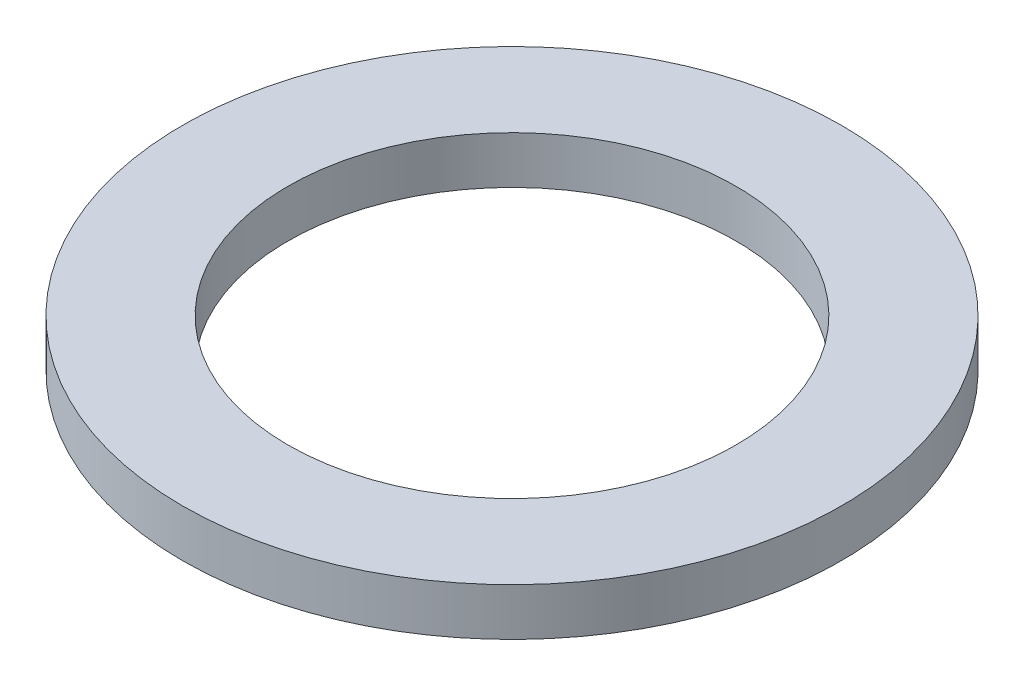
ISO-10303-21;
HEADER;
FILE_DESCRIPTION(('STEP AP214'),'2;1');
FILE_NAME('part.step','',(''),(''),'','','');
FILE_SCHEMA(('AUTOMOTIVE_DESIGN { 1 0 10303 214 1 1 1 1 }'));
ENDSEC;
DATA;
#1=APPLICATION_CONTEXT('core data for automotive mechanical design processes');
#2=APPLICATION_PROTOCOL_DEFINITION('international standard','automotive_design',2000,#1);
#3=PRODUCT_CONTEXT('',#1,'mechanical');
#4=PRODUCT('Part','Part','',(#3));
#5=PRODUCT_RELATED_PRODUCT_CATEGORY('part','',(#4));
#6=PRODUCT_DEFINITION_FORMATION('','',#4);
#7=PRODUCT_DEFINITION_CONTEXT('part definition',#1,'design');
#8=PRODUCT_DEFINITION('design','',#6,#7);
#9=PRODUCT_DEFINITION_SHAPE('','',#8);
#10=(LENGTH_UNIT() NAMED_UNIT(*) SI_UNIT(.MILLI.,.METRE.));
#11=(NAMED_UNIT(*) PLANE_ANGLE_UNIT() SI_UNIT($,.RADIAN.));
#12=(NAMED_UNIT(*) SI_UNIT($,.STERADIAN.) SOLID_ANGLE_UNIT());
#13=UNCERTAINTY_MEASURE_WITH_UNIT(LENGTH_MEASURE(1.E-05),#10,'distance_accuracy_value','');
#14=(GEOMETRIC_REPRESENTATION_CONTEXT(3) GLOBAL_UNCERTAINTY_ASSIGNED_CONTEXT((#13)) GLOBAL_UNIT_ASSIGNED_CONTEXT((#10,
#11,#12)) REPRESENTATION_CONTEXT('',''));
#15=CARTESIAN_POINT('',(0.,0.,0.));
#16=DIRECTION('',(0.,0.,1.));
#17=DIRECTION('',(1.,0.,0.));
#18=AXIS2_PLACEMENT_3D('',#15,#16,#17);
#19=CARTESIAN_POINT('',(0.,9.,0.));
#20=DIRECTION('',(0.,-1.,0.));
#21=DIRECTION('',(0.,0.,-1.));
#22=AXIS2_PLACEMENT_3D('',#19,#20,#21);
#23=CYLINDRICAL_SURFACE('',#22,62.5);
#24=CARTESIAN_POINT('',(0.,9.,0.));
#25=DIRECTION('',(0.,1.,0.));
#26=DIRECTION('',(0.,0.,1.));
#27=AXIS2_PLACEMENT_3D('',#24,#25,#26);
#28=CIRCLE('',#27,62.5);
#29=CARTESIAN_POINT('',(0.,9.,62.5));
#30=VERTEX_POINT('',#29);
#31=EDGE_CURVE('E10',#30,#30,#28,.T.);
#32=ORIENTED_EDGE('',*,*,#31,.F.);
#33=EDGE_LOOP('',(#32));
#34=FACE_BOUND('',#33,.T.);
#35=CARTESIAN_POINT('',(0.,0.,0.));
#36=DIRECTION('',(0.,1.,0.));
#37=DIRECTION('',(0.,0.,1.));
#38=AXIS2_PLACEMENT_3D('',#35,#36,#37);
#39=CIRCLE('',#38,62.5);
#40=CARTESIAN_POINT('',(0.,0.,62.5));
#41=VERTEX_POINT('',#40);
#42=EDGE_CURVE('E37',#41,#41,#39,.T.);
#43=ORIENTED_EDGE('',*,*,#42,.T.);
#44=EDGE_LOOP('',(#43));
#45=FACE_BOUND('',#44,.T.);
#46=ADVANCED_FACE('F40',(#34,#45),#23,.T.);
#47=CARTESIAN_POINT('',(0.,9.,0.));
#48=DIRECTION('',(0.,1.,0.));
#49=DIRECTION('',(0.,0.,1.));
#50=AXIS2_PLACEMENT_3D('',#47,#48,#49);
#51=PLANE('',#50);
#52=CARTESIAN_POINT('',(0.,9.,0.));
#53=DIRECTION('',(0.,1.,0.));
#54=DIRECTION('',(0.,0.,1.));
#55=AXIS2_PLACEMENT_3D('',#52,#53,#54);
#56=CIRCLE('',#55,42.5);
#57=CARTESIAN_POINT('',(0.,9.,42.5));
#58=VERTEX_POINT('',#57);
#59=EDGE_CURVE('E50',#58,#58,#56,.T.);
#60=ORIENTED_EDGE('',*,*,#59,.F.);
#61=EDGE_LOOP('',(#60));
#62=FACE_BOUND('',#61,.T.);
#63=ORIENTED_EDGE('',*,*,#31,.T.);
#64=EDGE_LOOP('',(#63));
#65=FACE_BOUND('',#64,.T.);
#66=ADVANCED_FACE('F59',(#62,#65),#51,.T.);
#67=CARTESIAN_POINT('',(0.,0.,0.));
#68=DIRECTION('',(0.,1.,0.));
#69=DIRECTION('',(0.,0.,1.));
#70=AXIS2_PLACEMENT_3D('',#67,#68,#69);
#71=PLANE('',#70);
#72=CARTESIAN_POINT('',(0.,0.,0.));
#73=DIRECTION('',(0.,1.,0.));
#74=DIRECTION('',(0.,0.,1.));
#75=AXIS2_PLACEMENT_3D('',#72,#73,#74);
#76=CIRCLE('',#75,42.5);
#77=CARTESIAN_POINT('',(0.,0.,42.5));
#78=VERTEX_POINT('',#77);
#79=EDGE_CURVE('E47',#78,#78,#76,.T.);
#80=ORIENTED_EDGE('',*,*,#79,.T.);
#81=EDGE_LOOP('',(#80));
#82=FACE_BOUND('',#81,.T.);
#83=ORIENTED_EDGE('',*,*,#42,.F.);
#84=EDGE_LOOP('',(#83));
#85=FACE_BOUND('',#84,.T.);
#86=ADVANCED_FACE('F58',(#82,#85),#71,.F.);
#87=CARTESIAN_POINT('',(0.,9.,0.));
#88=DIRECTION('',(0.,-1.,0.));
#89=DIRECTION('',(0.,0.,-1.));
#90=AXIS2_PLACEMENT_3D('',#87,#88,#89);
#91=CYLINDRICAL_SURFACE('',#90,42.5);
#92=ORIENTED_EDGE('',*,*,#59,.T.);
#93=EDGE_LOOP('',(#92));
#94=FACE_BOUND('',#93,.T.);
#95=ORIENTED_EDGE('',*,*,#79,.F.);
#96=EDGE_LOOP('',(#95));
#97=FACE_BOUND('',#96,.T.);
#98=ADVANCED_FACE('F54',(#94,#97),#91,.F.);
#99=CLOSED_SHELL('',(#46,#66,#86,#98));
#100=MANIFOLD_SOLID_BREP('B2',#99);
#101=ADVANCED_BREP_SHAPE_REPRESENTATION('',(#18,#100),#14);
#102=SHAPE_DEFINITION_REPRESENTATION(#9,#101);
ENDSEC;
END-ISO-10303-21;
